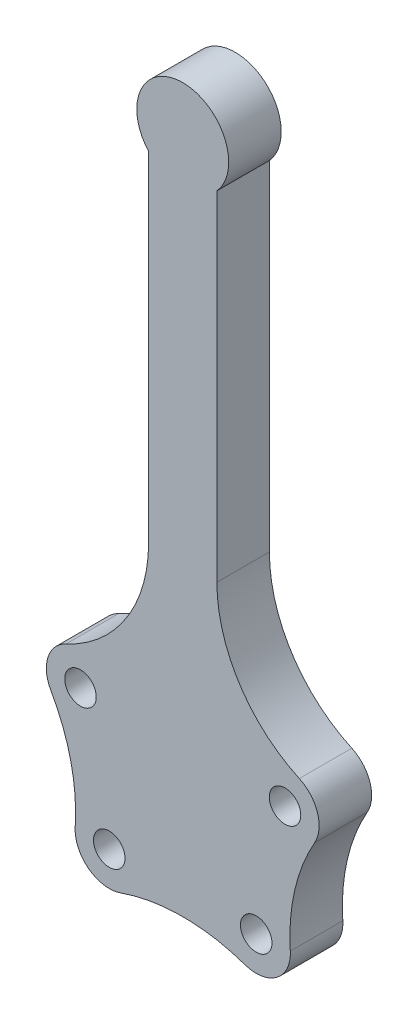
ISO-10303-21;
HEADER;
FILE_DESCRIPTION(('STEP AP214'),'2;1');
FILE_NAME('part.step','',(''),(''),'','','');
FILE_SCHEMA(('AUTOMOTIVE_DESIGN { 1 0 10303 214 1 1 1 1 }'));
ENDSEC;
DATA;
#1=APPLICATION_CONTEXT('core data for automotive mechanical design processes');
#2=APPLICATION_PROTOCOL_DEFINITION('international standard','automotive_design',2000,#1);
#3=PRODUCT_CONTEXT('',#1,'mechanical');
#4=PRODUCT('Part','Part','',(#3));
#5=PRODUCT_RELATED_PRODUCT_CATEGORY('part','',(#4));
#6=PRODUCT_DEFINITION_FORMATION('','',#4);
#7=PRODUCT_DEFINITION_CONTEXT('part definition',#1,'design');
#8=PRODUCT_DEFINITION('design','',#6,#7);
#9=PRODUCT_DEFINITION_SHAPE('','',#8);
#10=(LENGTH_UNIT() NAMED_UNIT(*) SI_UNIT(.MILLI.,.METRE.));
#11=(NAMED_UNIT(*) PLANE_ANGLE_UNIT() SI_UNIT($,.RADIAN.));
#12=(NAMED_UNIT(*) SI_UNIT($,.STERADIAN.) SOLID_ANGLE_UNIT());
#13=UNCERTAINTY_MEASURE_WITH_UNIT(LENGTH_MEASURE(1.E-05),#10,'distance_accuracy_value','');
#14=(GEOMETRIC_REPRESENTATION_CONTEXT(3) GLOBAL_UNCERTAINTY_ASSIGNED_CONTEXT((#13)) GLOBAL_UNIT_ASSIGNED_CONTEXT((#10,
#11,#12)) REPRESENTATION_CONTEXT('',''));
#15=CARTESIAN_POINT('',(0.,0.,0.));
#16=DIRECTION('',(0.,0.,1.));
#17=DIRECTION('',(1.,0.,0.));
#18=AXIS2_PLACEMENT_3D('',#15,#16,#17);
#19=CARTESIAN_POINT('',(38948.1934291581,20327.8011800405,20000.));
#20=DIRECTION('',(0.,0.,-1.));
#21=DIRECTION('',(-1.,0.,0.));
#22=AXIS2_PLACEMENT_3D('',#19,#20,#21);
#23=CYLINDRICAL_SURFACE('',#22,6000.);
#24=CARTESIAN_POINT('',(38948.1934291581,20327.8011800405,20000.));
#25=DIRECTION('',(0.,0.,1.));
#26=DIRECTION('',(1.,0.,0.));
#27=AXIS2_PLACEMENT_3D('',#24,#25,#26);
#28=CIRCLE('',#27,6000.);
#29=CARTESIAN_POINT('',(44948.1934291581,20327.8011800405,20000.));
#30=VERTEX_POINT('',#29);
#31=EDGE_CURVE('E256',#30,#30,#28,.F.);
#32=ORIENTED_EDGE('',*,*,#31,.F.);
#33=EDGE_LOOP('',(#32));
#34=FACE_BOUND('',#33,.T.);
#35=CARTESIAN_POINT('',(38948.1934291581,20327.8011800405,0.));
#36=DIRECTION('',(0.,0.,1.));
#37=DIRECTION('',(1.,0.,0.));
#38=AXIS2_PLACEMENT_3D('',#35,#36,#37);
#39=CIRCLE('',#38,6000.);
#40=CARTESIAN_POINT('',(44948.1934291581,20327.8011800405,0.));
#41=VERTEX_POINT('',#40);
#42=EDGE_CURVE('E312',#41,#41,#39,.F.);
#43=ORIENTED_EDGE('',*,*,#42,.T.);
#44=EDGE_LOOP('',(#43));
#45=FACE_BOUND('',#44,.T.);
#46=ADVANCED_FACE('F117',(#34,#45),#23,.F.);
#47=CARTESIAN_POINT('',(-38950.4949683036,20327.8011800405,20000.));
#48=DIRECTION('',(0.,0.,-1.));
#49=DIRECTION('',(-1.,0.,0.));
#50=AXIS2_PLACEMENT_3D('',#47,#48,#49);
#51=CYLINDRICAL_SURFACE('',#50,6000.);
#52=CARTESIAN_POINT('',(-38950.4949683036,20327.8011800405,20000.));
#53=DIRECTION('',(0.,0.,1.));
#54=DIRECTION('',(1.,0.,0.));
#55=AXIS2_PLACEMENT_3D('',#52,#53,#54);
#56=CIRCLE('',#55,6000.);
#57=CARTESIAN_POINT('',(-32950.4949683036,20327.8011800405,20000.));
#58=VERTEX_POINT('',#57);
#59=EDGE_CURVE('E252',#58,#58,#56,.T.);
#60=ORIENTED_EDGE('',*,*,#59,.T.);
#61=EDGE_LOOP('',(#60));
#62=FACE_BOUND('',#61,.T.);
#63=CARTESIAN_POINT('',(-38950.4949683036,20327.8011800405,0.));
#64=DIRECTION('',(0.,0.,1.));
#65=DIRECTION('',(1.,0.,0.));
#66=AXIS2_PLACEMENT_3D('',#63,#64,#65);
#67=CIRCLE('',#66,6000.);
#68=CARTESIAN_POINT('',(-32950.4949683036,20327.8011800405,0.));
#69=VERTEX_POINT('',#68);
#70=EDGE_CURVE('E308',#69,#69,#67,.T.);
#71=ORIENTED_EDGE('',*,*,#70,.F.);
#72=EDGE_LOOP('',(#71));
#73=FACE_BOUND('',#72,.T.);
#74=ADVANCED_FACE('F402',(#62,#73),#51,.F.);
#75=CARTESIAN_POINT('',(27985.1400829734,-27359.9179610255,20000.));
#76=DIRECTION('',(0.,0.,-1.));
#77=DIRECTION('',(-1.,0.,0.));
#78=AXIS2_PLACEMENT_3D('',#75,#76,#77);
#79=CYLINDRICAL_SURFACE('',#78,6000.);
#80=CARTESIAN_POINT('',(27985.1400829734,-27359.9179610255,20000.));
#81=DIRECTION('',(0.,0.,1.));
#82=DIRECTION('',(1.,0.,0.));
#83=AXIS2_PLACEMENT_3D('',#80,#81,#82);
#84=CIRCLE('',#83,6000.);
#85=CARTESIAN_POINT('',(33985.1400829734,-27359.9179610255,20000.));
#86=VERTEX_POINT('',#85);
#87=EDGE_CURVE('E248',#86,#86,#84,.T.);
#88=ORIENTED_EDGE('',*,*,#87,.T.);
#89=EDGE_LOOP('',(#88));
#90=FACE_BOUND('',#89,.T.);
#91=CARTESIAN_POINT('',(27985.1400829734,-27359.9179610255,0.));
#92=DIRECTION('',(0.,0.,1.));
#93=DIRECTION('',(1.,0.,0.));
#94=AXIS2_PLACEMENT_3D('',#91,#92,#93);
#95=CIRCLE('',#94,6000.);
#96=CARTESIAN_POINT('',(33985.1400829734,-27359.9179610255,0.));
#97=VERTEX_POINT('',#96);
#98=EDGE_CURVE('E304',#97,#97,#95,.T.);
#99=ORIENTED_EDGE('',*,*,#98,.F.);
#100=EDGE_LOOP('',(#99));
#101=FACE_BOUND('',#100,.T.);
#102=ADVANCED_FACE('F408',(#90,#101),#79,.F.);
#103=CARTESIAN_POINT('',(-27987.4416221189,-27359.9179610255,20000.));
#104=DIRECTION('',(0.,0.,-1.));
#105=DIRECTION('',(-1.,0.,0.));
#106=AXIS2_PLACEMENT_3D('',#103,#104,#105);
#107=CYLINDRICAL_SURFACE('',#106,6000.);
#108=CARTESIAN_POINT('',(-27987.4416221189,-27359.9179610255,20000.));
#109=DIRECTION('',(0.,0.,1.));
#110=DIRECTION('',(1.,0.,0.));
#111=AXIS2_PLACEMENT_3D('',#108,#109,#110);
#112=CIRCLE('',#111,6000.);
#113=CARTESIAN_POINT('',(-21987.4416221189,-27359.9179610255,20000.));
#114=VERTEX_POINT('',#113);
#115=EDGE_CURVE('E241',#114,#114,#112,.T.);
#116=ORIENTED_EDGE('',*,*,#115,.T.);
#117=EDGE_LOOP('',(#116));
#118=FACE_BOUND('',#117,.T.);
#119=CARTESIAN_POINT('',(-27987.4416221189,-27359.9179610255,0.));
#120=DIRECTION('',(0.,0.,1.));
#121=DIRECTION('',(1.,0.,0.));
#122=AXIS2_PLACEMENT_3D('',#119,#120,#121);
#123=CIRCLE('',#122,6000.);
#124=CARTESIAN_POINT('',(-21987.4416221189,-27359.9179610255,0.));
#125=VERTEX_POINT('',#124);
#126=EDGE_CURVE('E300',#125,#125,#123,.T.);
#127=ORIENTED_EDGE('',*,*,#126,.F.);
#128=EDGE_LOOP('',(#127));
#129=FACE_BOUND('',#128,.T.);
#130=ADVANCED_FACE('F418',(#118,#129),#107,.F.);
#131=CARTESIAN_POINT('',(66998.8492304273,81173.1848103433,20000.));
#132=DIRECTION('',(0.,0.,-1.));
#133=DIRECTION('',(-1.,0.,0.));
#134=AXIS2_PLACEMENT_3D('',#131,#132,#133);
#135=CYLINDRICAL_SURFACE('',#134,54000.);
#136=CARTESIAN_POINT('',(66998.8492304273,81173.1848103433,0.));
#137=DIRECTION('',(0.,0.,1.));
#138=DIRECTION('',(1.,0.,0.));
#139=AXIS2_PLACEMENT_3D('',#136,#137,#138);
#140=CIRCLE('',#139,54000.);
#141=CARTESIAN_POINT('',(44390.8579876134,32133.6218844276,0.));
#142=VERTEX_POINT('',#141);
#143=CARTESIAN_POINT('',(12998.8492304273,81173.1848103433,0.));
#144=VERTEX_POINT('',#143);
#145=EDGE_CURVE('E264',#142,#144,#140,.F.);
#146=ORIENTED_EDGE('',*,*,#145,.T.);
#147=DIRECTION('',(0.,0.,-1.));
#148=VECTOR('',#147,1.);
#149=CARTESIAN_POINT('',(12998.8492304273,81173.1848103433,20000.));
#150=LINE('',#149,#148);
#151=CARTESIAN_POINT('',(12998.8492304273,81173.1848103433,20000.));
#152=VERTEX_POINT('',#151);
#153=EDGE_CURVE('E128',#152,#144,#150,.T.);
#154=ORIENTED_EDGE('',*,*,#153,.F.);
#155=CARTESIAN_POINT('',(66998.8492304273,81173.1848103433,20000.));
#156=DIRECTION('',(0.,0.,1.));
#157=DIRECTION('',(1.,0.,0.));
#158=AXIS2_PLACEMENT_3D('',#155,#156,#157);
#159=CIRCLE('',#158,54000.);
#160=CARTESIAN_POINT('',(44390.8579876134,32133.6218844276,20000.));
#161=VERTEX_POINT('',#160);
#162=EDGE_CURVE('E373',#161,#152,#159,.F.);
#163=ORIENTED_EDGE('',*,*,#162,.F.);
#164=DIRECTION('',(0.,0.,-1.));
#165=VECTOR('',#164,1.);
#166=CARTESIAN_POINT('',(44390.8579876134,32133.6218844276,20000.));
#167=LINE('',#166,#165);
#168=EDGE_CURVE('E12',#161,#142,#167,.T.);
#169=ORIENTED_EDGE('',*,*,#168,.T.);
#170=EDGE_LOOP('',(#146,#154,#163,#169));
#171=FACE_BOUND('',#170,.T.);
#172=ADVANCED_FACE('F422',(#171),#135,.F.);
#173=CARTESIAN_POINT('',(12998.8492304273,1.78842359855495E-13,20000.));
#174=DIRECTION('',(-1.,0.,0.));
#175=DIRECTION('',(0.,-1.,0.));
#176=AXIS2_PLACEMENT_3D('',#173,#174,#175);
#177=PLANE('',#176);
#178=DIRECTION('',(0.,1.,0.));
#179=VECTOR('',#178,1.);
#180=CARTESIAN_POINT('',(12998.8492304273,1.78842359855495E-13,0.));
#181=LINE('',#180,#179);
#182=CARTESIAN_POINT('',(12998.8492304273,210284.62548614,0.));
#183=VERTEX_POINT('',#182);
#184=EDGE_CURVE('E268',#144,#183,#181,.T.);
#185=ORIENTED_EDGE('',*,*,#184,.T.);
#186=DIRECTION('',(0.,0.,-1.));
#187=VECTOR('',#186,1.);
#188=CARTESIAN_POINT('',(12998.8492304273,210284.62548614,20000.));
#189=LINE('',#188,#187);
#190=CARTESIAN_POINT('',(12998.8492304273,210284.62548614,20000.));
#191=VERTEX_POINT('',#190);
#192=EDGE_CURVE('E338',#191,#183,#189,.T.);
#193=ORIENTED_EDGE('',*,*,#192,.F.);
#194=DIRECTION('',(0.,1.,0.));
#195=VECTOR('',#194,1.);
#196=CARTESIAN_POINT('',(12998.8492304273,1.78842359855495E-13,20000.));
#197=LINE('',#196,#195);
#198=EDGE_CURVE('E367',#152,#191,#197,.T.);
#199=ORIENTED_EDGE('',*,*,#198,.F.);
#200=ORIENTED_EDGE('',*,*,#153,.T.);
#201=EDGE_LOOP('',(#185,#193,#199,#200));
#202=FACE_BOUND('',#201,.T.);
#203=ADVANCED_FACE('F506',(#202),#177,.F.);
#204=CARTESIAN_POINT('',(-13001.1507695727,8.94370125866532E-13,20000.));
#205=DIRECTION('',(-1.,0.,0.));
#206=DIRECTION('',(0.,-1.,0.));
#207=AXIS2_PLACEMENT_3D('',#204,#205,#206);
#208=PLANE('',#207);
#209=DIRECTION('',(0.,1.,0.));
#210=VECTOR('',#209,1.);
#211=CARTESIAN_POINT('',(-13001.1507695727,8.94370125866532E-13,0.));
#212=LINE('',#211,#210);
#213=CARTESIAN_POINT('',(-13001.1507695727,81173.1848103433,0.));
#214=VERTEX_POINT('',#213);
#215=CARTESIAN_POINT('',(-13001.1507695727,210284.62548614,0.));
#216=VERTEX_POINT('',#215);
#217=EDGE_CURVE('E272',#214,#216,#212,.T.);
#218=ORIENTED_EDGE('',*,*,#217,.F.);
#219=DIRECTION('',(0.,0.,-1.));
#220=VECTOR('',#219,1.);
#221=CARTESIAN_POINT('',(-13001.1507695727,81173.1848103433,20000.));
#222=LINE('',#221,#220);
#223=CARTESIAN_POINT('',(-13001.1507695727,81173.1848103433,20000.));
#224=VERTEX_POINT('',#223);
#225=EDGE_CURVE('E332',#224,#214,#222,.T.);
#226=ORIENTED_EDGE('',*,*,#225,.F.);
#227=DIRECTION('',(0.,1.,0.));
#228=VECTOR('',#227,1.);
#229=CARTESIAN_POINT('',(-13001.1507695727,8.94370125866532E-13,20000.));
#230=LINE('',#229,#228);
#231=CARTESIAN_POINT('',(-13001.1507695727,210284.62548614,20000.));
#232=VERTEX_POINT('',#231);
#233=EDGE_CURVE('E362',#224,#232,#230,.T.);
#234=ORIENTED_EDGE('',*,*,#233,.T.);
#235=DIRECTION('',(0.,0.,-1.));
#236=VECTOR('',#235,1.);
#237=CARTESIAN_POINT('',(-13001.1507695727,210284.62548614,20000.));
#238=LINE('',#237,#236);
#239=EDGE_CURVE('E335',#232,#216,#238,.T.);
#240=ORIENTED_EDGE('',*,*,#239,.T.);
#241=EDGE_LOOP('',(#218,#226,#234,#240));
#242=FACE_BOUND('',#241,.T.);
#243=ADVANCED_FACE('F361',(#242),#208,.T.);
#244=CARTESIAN_POINT('',(-67001.1507695727,81173.1848103433,20000.));
#245=DIRECTION('',(0.,0.,-1.));
#246=DIRECTION('',(-1.,0.,0.));
#247=AXIS2_PLACEMENT_3D('',#244,#245,#246);
#248=CYLINDRICAL_SURFACE('',#247,54000.);
#249=CARTESIAN_POINT('',(-67001.1507695727,81173.1848103433,0.));
#250=DIRECTION('',(0.,0.,1.));
#251=DIRECTION('',(1.,0.,0.));
#252=AXIS2_PLACEMENT_3D('',#249,#250,#251);
#253=CIRCLE('',#252,54000.);
#254=CARTESIAN_POINT('',(-44393.1595267588,32133.6218844276,0.));
#255=VERTEX_POINT('',#254);
#256=EDGE_CURVE('E276',#255,#214,#253,.T.);
#257=ORIENTED_EDGE('',*,*,#256,.F.);
#258=DIRECTION('',(0.,0.,-1.));
#259=VECTOR('',#258,1.);
#260=CARTESIAN_POINT('',(-44393.1595267588,32133.6218844276,20000.));
#261=LINE('',#260,#259);
#262=CARTESIAN_POINT('',(-44393.1595267588,32133.6218844276,20000.));
#263=VERTEX_POINT('',#262);
#264=EDGE_CURVE('E329',#263,#255,#261,.T.);
#265=ORIENTED_EDGE('',*,*,#264,.F.);
#266=CARTESIAN_POINT('',(-67001.1507695727,81173.1848103433,20000.));
#267=DIRECTION('',(0.,0.,1.));
#268=DIRECTION('',(1.,0.,0.));
#269=AXIS2_PLACEMENT_3D('',#266,#267,#268);
#270=CIRCLE('',#269,54000.);
#271=EDGE_CURVE('E366',#263,#224,#270,.T.);
#272=ORIENTED_EDGE('',*,*,#271,.T.);
#273=ORIENTED_EDGE('',*,*,#225,.T.);
#274=EDGE_LOOP('',(#257,#265,#272,#273));
#275=FACE_BOUND('',#274,.T.);
#276=ADVANCED_FACE('F490',(#275),#248,.F.);
#277=CARTESIAN_POINT('',(-38950.4949683036,20327.8011800405,20000.));
#278=DIRECTION('',(0.,0.,-1.));
#279=DIRECTION('',(-1.,0.,0.));
#280=AXIS2_PLACEMENT_3D('',#277,#278,#279);
#281=CYLINDRICAL_SURFACE('',#280,13000.);
#282=CARTESIAN_POINT('',(-38950.4949683036,20327.8011800405,0.));
#283=DIRECTION('',(0.,0.,1.));
#284=DIRECTION('',(1.,0.,0.));
#285=AXIS2_PLACEMENT_3D('',#282,#283,#284);
#286=CIRCLE('',#285,13000.);
#287=CARTESIAN_POINT('',(-50245.4913477451,13891.7265387392,0.));
#288=VERTEX_POINT('',#287);
#289=EDGE_CURVE('E280',#255,#288,#286,.T.);
#290=ORIENTED_EDGE('',*,*,#289,.T.);
#291=DIRECTION('',(0.,0.,-1.));
#292=VECTOR('',#291,1.);
#293=CARTESIAN_POINT('',(-50245.4913477451,13891.7265387392,20000.));
#294=LINE('',#293,#292);
#295=CARTESIAN_POINT('',(-50245.4913477451,13891.7265387392,20000.));
#296=VERTEX_POINT('',#295);
#297=EDGE_CURVE('E326',#296,#288,#294,.T.);
#298=ORIENTED_EDGE('',*,*,#297,.F.);
#299=CARTESIAN_POINT('',(-38950.4949683036,20327.8011800405,20000.));
#300=DIRECTION('',(0.,0.,1.));
#301=DIRECTION('',(1.,0.,0.));
#302=AXIS2_PLACEMENT_3D('',#299,#300,#301);
#303=CIRCLE('',#302,13000.);
#304=EDGE_CURVE('E371',#263,#296,#303,.T.);
#305=ORIENTED_EDGE('',*,*,#304,.F.);
#306=ORIENTED_EDGE('',*,*,#264,.T.);
#307=EDGE_LOOP('',(#290,#298,#305,#306));
#308=FACE_BOUND('',#307,.T.);
#309=ADVANCED_FACE('F389',(#308),#281,.T.);
#310=CARTESIAN_POINT('',(-112802.394372345,-21754.2253207756,20000.));
#311=DIRECTION('',(0.,0.,-1.));
#312=DIRECTION('',(-1.,0.,0.));
#313=AXIS2_PLACEMENT_3D('',#310,#311,#312);
#314=CYLINDRICAL_SURFACE('',#313,72000.);
#315=CARTESIAN_POINT('',(-112802.394372345,-21754.2253207756,0.));
#316=DIRECTION('',(0.,0.,1.));
#317=DIRECTION('',(1.,0.,0.));
#318=AXIS2_PLACEMENT_3D('',#315,#316,#317);
#319=CIRCLE('',#318,72000.);
#320=CARTESIAN_POINT('',(-40959.1402780358,-26502.5767336931,0.));
#321=VERTEX_POINT('',#320);
#322=EDGE_CURVE('E284',#321,#288,#319,.T.);
#323=ORIENTED_EDGE('',*,*,#322,.F.);
#324=DIRECTION('',(0.,0.,-1.));
#325=VECTOR('',#324,1.);
#326=CARTESIAN_POINT('',(-40959.1402780358,-26502.5767336931,20000.));
#327=LINE('',#326,#325);
#328=CARTESIAN_POINT('',(-40959.1402780358,-26502.5767336931,20000.));
#329=VERTEX_POINT('',#328);
#330=EDGE_CURVE('E323',#329,#321,#327,.T.);
#331=ORIENTED_EDGE('',*,*,#330,.F.);
#332=CARTESIAN_POINT('',(-112802.394372345,-21754.2253207756,20000.));
#333=DIRECTION('',(0.,0.,1.));
#334=DIRECTION('',(1.,0.,0.));
#335=AXIS2_PLACEMENT_3D('',#332,#333,#334);
#336=CIRCLE('',#335,72000.);
#337=EDGE_CURVE('E379',#329,#296,#336,.T.);
#338=ORIENTED_EDGE('',*,*,#337,.T.);
#339=ORIENTED_EDGE('',*,*,#297,.T.);
#340=EDGE_LOOP('',(#323,#331,#338,#339));
#341=FACE_BOUND('',#340,.T.);
#342=ADVANCED_FACE('F385',(#341),#314,.F.);
#343=CARTESIAN_POINT('',(-27987.4416221189,-27359.9179610255,20000.));
#344=DIRECTION('',(0.,0.,-1.));
#345=DIRECTION('',(-1.,0.,0.));
#346=AXIS2_PLACEMENT_3D('',#343,#344,#345);
#347=CYLINDRICAL_SURFACE('',#346,13000.);
#348=CARTESIAN_POINT('',(-27987.4416221189,-27359.9179610255,0.));
#349=DIRECTION('',(0.,0.,1.));
#350=DIRECTION('',(1.,0.,0.));
#351=AXIS2_PLACEMENT_3D('',#348,#349,#350);
#352=CIRCLE('',#351,13000.);
#353=CARTESIAN_POINT('',(-23707.1853740824,-39635.0719906556,0.));
#354=VERTEX_POINT('',#353);
#355=EDGE_CURVE('E288',#321,#354,#352,.T.);
#356=ORIENTED_EDGE('',*,*,#355,.T.);
#357=DIRECTION('',(0.,0.,-1.));
#358=VECTOR('',#357,1.);
#359=CARTESIAN_POINT('',(-23707.1853740824,-39635.0719906556,20000.));
#360=LINE('',#359,#358);
#361=CARTESIAN_POINT('',(-23707.1853740824,-39635.0719906556,20000.));
#362=VERTEX_POINT('',#361);
#363=EDGE_CURVE('E226',#362,#354,#360,.T.);
#364=ORIENTED_EDGE('',*,*,#363,.F.);
#365=CARTESIAN_POINT('',(-27987.4416221189,-27359.9179610255,20000.));
#366=DIRECTION('',(0.,0.,1.));
#367=DIRECTION('',(1.,0.,0.));
#368=AXIS2_PLACEMENT_3D('',#365,#366,#367);
#369=CIRCLE('',#368,13000.);
#370=EDGE_CURVE('E233',#329,#362,#369,.T.);
#371=ORIENTED_EDGE('',*,*,#370,.F.);
#372=ORIENTED_EDGE('',*,*,#330,.T.);
#373=EDGE_LOOP('',(#356,#364,#371,#372));
#374=FACE_BOUND('',#373,.T.);
#375=ADVANCED_FACE('F392',(#374),#347,.T.);
#376=CARTESIAN_POINT('',(-1.15076957266471,-107620.540462453,20000.));
#377=DIRECTION('',(0.,0.,-1.));
#378=DIRECTION('',(-1.,0.,0.));
#379=AXIS2_PLACEMENT_3D('',#376,#377,#378);
#380=CYLINDRICAL_SURFACE('',#379,72000.);
#381=CARTESIAN_POINT('',(-1.15076957266471,-107620.540462453,0.));
#382=DIRECTION('',(0.,0.,1.));
#383=DIRECTION('',(1.,0.,0.));
#384=AXIS2_PLACEMENT_3D('',#381,#382,#383);
#385=CIRCLE('',#384,72000.);
#386=CARTESIAN_POINT('',(23704.883834937,-39635.0719906556,0.));
#387=VERTEX_POINT('',#386);
#388=EDGE_CURVE('E220',#387,#354,#385,.T.);
#389=ORIENTED_EDGE('',*,*,#388,.F.);
#390=DIRECTION('',(0.,0.,-1.));
#391=VECTOR('',#390,1.);
#392=CARTESIAN_POINT('',(23704.883834937,-39635.0719906556,20000.));
#393=LINE('',#392,#391);
#394=CARTESIAN_POINT('',(23704.883834937,-39635.0719906556,20000.));
#395=VERTEX_POINT('',#394);
#396=EDGE_CURVE('E215',#395,#387,#393,.T.);
#397=ORIENTED_EDGE('',*,*,#396,.F.);
#398=CARTESIAN_POINT('',(-1.15076957266471,-107620.540462453,20000.));
#399=DIRECTION('',(0.,0.,1.));
#400=DIRECTION('',(1.,0.,0.));
#401=AXIS2_PLACEMENT_3D('',#398,#399,#400);
#402=CIRCLE('',#401,72000.);
#403=EDGE_CURVE('E218',#395,#362,#402,.T.);
#404=ORIENTED_EDGE('',*,*,#403,.T.);
#405=ORIENTED_EDGE('',*,*,#363,.T.);
#406=EDGE_LOOP('',(#389,#397,#404,#405));
#407=FACE_BOUND('',#406,.T.);
#408=ADVANCED_FACE('F217',(#407),#380,.F.);
#409=CARTESIAN_POINT('',(27985.1400829734,-27359.9179610255,20000.));
#410=DIRECTION('',(0.,0.,-1.));
#411=DIRECTION('',(-1.,0.,0.));
#412=AXIS2_PLACEMENT_3D('',#409,#410,#411);
#413=CYLINDRICAL_SURFACE('',#412,13000.);
#414=CARTESIAN_POINT('',(27985.1400829734,-27359.9179610255,0.));
#415=DIRECTION('',(0.,0.,1.));
#416=DIRECTION('',(1.,0.,0.));
#417=AXIS2_PLACEMENT_3D('',#414,#415,#416);
#418=CIRCLE('',#417,13000.);
#419=CARTESIAN_POINT('',(40956.8387388903,-26502.5767336931,0.));
#420=VERTEX_POINT('',#419);
#421=EDGE_CURVE('E294',#420,#387,#418,.F.);
#422=ORIENTED_EDGE('',*,*,#421,.F.);
#423=DIRECTION('',(0.,0.,-1.));
#424=VECTOR('',#423,1.);
#425=CARTESIAN_POINT('',(40956.8387388903,-26502.5767336931,20000.));
#426=LINE('',#425,#424);
#427=CARTESIAN_POINT('',(40956.8387388903,-26502.5767336931,20000.));
#428=VERTEX_POINT('',#427);
#429=EDGE_CURVE('E176',#428,#420,#426,.T.);
#430=ORIENTED_EDGE('',*,*,#429,.F.);
#431=CARTESIAN_POINT('',(27985.1400829734,-27359.9179610255,20000.));
#432=DIRECTION('',(0.,0.,1.));
#433=DIRECTION('',(1.,0.,0.));
#434=AXIS2_PLACEMENT_3D('',#431,#432,#433);
#435=CIRCLE('',#434,13000.);
#436=EDGE_CURVE('E230',#428,#395,#435,.F.);
#437=ORIENTED_EDGE('',*,*,#436,.T.);
#438=ORIENTED_EDGE('',*,*,#396,.T.);
#439=EDGE_LOOP('',(#422,#430,#437,#438));
#440=FACE_BOUND('',#439,.T.);
#441=ADVANCED_FACE('F237',(#440),#413,.T.);
#442=CARTESIAN_POINT('',(112800.092833199,-21754.2253207756,20000.));
#443=DIRECTION('',(0.,0.,-1.));
#444=DIRECTION('',(-1.,0.,0.));
#445=AXIS2_PLACEMENT_3D('',#442,#443,#444);
#446=CYLINDRICAL_SURFACE('',#445,72000.);
#447=CARTESIAN_POINT('',(112800.092833199,-21754.2253207756,0.));
#448=DIRECTION('',(0.,0.,1.));
#449=DIRECTION('',(1.,0.,0.));
#450=AXIS2_PLACEMENT_3D('',#447,#448,#449);
#451=CIRCLE('',#450,72000.);
#452=CARTESIAN_POINT('',(50243.1898085997,13891.7265387392,0.));
#453=VERTEX_POINT('',#452);
#454=EDGE_CURVE('E297',#420,#453,#451,.F.);
#455=ORIENTED_EDGE('',*,*,#454,.T.);
#456=DIRECTION('',(0.,0.,-1.));
#457=VECTOR('',#456,1.);
#458=CARTESIAN_POINT('',(50243.1898085997,13891.7265387392,20000.));
#459=LINE('',#458,#457);
#460=CARTESIAN_POINT('',(50243.1898085997,13891.7265387392,20000.));
#461=VERTEX_POINT('',#460);
#462=EDGE_CURVE('E183',#461,#453,#459,.T.);
#463=ORIENTED_EDGE('',*,*,#462,.F.);
#464=CARTESIAN_POINT('',(112800.092833199,-21754.2253207756,20000.));
#465=DIRECTION('',(0.,0.,1.));
#466=DIRECTION('',(1.,0.,0.));
#467=AXIS2_PLACEMENT_3D('',#464,#465,#466);
#468=CIRCLE('',#467,72000.);
#469=EDGE_CURVE('E137',#428,#461,#468,.F.);
#470=ORIENTED_EDGE('',*,*,#469,.F.);
#471=ORIENTED_EDGE('',*,*,#429,.T.);
#472=EDGE_LOOP('',(#455,#463,#470,#471));
#473=FACE_BOUND('',#472,.T.);
#474=ADVANCED_FACE('F424',(#473),#446,.F.);
#475=CARTESIAN_POINT('',(38948.1934291581,20327.8011800405,20000.));
#476=DIRECTION('',(0.,0.,-1.));
#477=DIRECTION('',(-1.,0.,0.));
#478=AXIS2_PLACEMENT_3D('',#475,#476,#477);
#479=CYLINDRICAL_SURFACE('',#478,13000.);
#480=CARTESIAN_POINT('',(38948.1934291581,20327.8011800405,0.));
#481=DIRECTION('',(0.,0.,1.));
#482=DIRECTION('',(1.,0.,0.));
#483=AXIS2_PLACEMENT_3D('',#480,#481,#482);
#484=CIRCLE('',#483,13000.);
#485=EDGE_CURVE('E260',#142,#453,#484,.F.);
#486=ORIENTED_EDGE('',*,*,#485,.F.);
#487=ORIENTED_EDGE('',*,*,#168,.F.);
#488=CARTESIAN_POINT('',(38948.1934291581,20327.8011800405,20000.));
#489=DIRECTION('',(0.,0.,1.));
#490=DIRECTION('',(1.,0.,0.));
#491=AXIS2_PLACEMENT_3D('',#488,#489,#490);
#492=CIRCLE('',#491,13000.);
#493=EDGE_CURVE('E316',#161,#461,#492,.F.);
#494=ORIENTED_EDGE('',*,*,#493,.T.);
#495=ORIENTED_EDGE('',*,*,#462,.T.);
#496=EDGE_LOOP('',(#486,#487,#494,#495));
#497=FACE_BOUND('',#496,.T.);
#498=ADVANCED_FACE('F427',(#497),#479,.T.);
#499=CARTESIAN_POINT('',(0.,0.,0.));
#500=DIRECTION('',(0.,0.,1.));
#501=DIRECTION('',(1.,0.,0.));
#502=AXIS2_PLACEMENT_3D('',#499,#500,#501);
#503=PLANE('',#502);
#504=ORIENTED_EDGE('',*,*,#485,.T.);
#505=ORIENTED_EDGE('',*,*,#454,.F.);
#506=ORIENTED_EDGE('',*,*,#421,.T.);
#507=ORIENTED_EDGE('',*,*,#388,.T.);
#508=ORIENTED_EDGE('',*,*,#355,.F.);
#509=ORIENTED_EDGE('',*,*,#322,.T.);
#510=ORIENTED_EDGE('',*,*,#289,.F.);
#511=ORIENTED_EDGE('',*,*,#256,.T.);
#512=ORIENTED_EDGE('',*,*,#217,.T.);
#513=CARTESIAN_POINT('',(-1.15076957270657,222000.,0.));
#514=DIRECTION('',(0.,0.,1.));
#515=DIRECTION('',(1.,0.,0.));
#516=AXIS2_PLACEMENT_3D('',#513,#514,#515);
#517=CIRCLE('',#516,17500.);
#518=EDGE_CURVE('E121',#183,#216,#517,.T.);
#519=ORIENTED_EDGE('',*,*,#518,.F.);
#520=ORIENTED_EDGE('',*,*,#184,.F.);
#521=ORIENTED_EDGE('',*,*,#145,.F.);
#522=EDGE_LOOP('',(#504,#505,#506,#507,#508,#509,#510,#511,#512,#519,#520,#521));
#523=FACE_BOUND('',#522,.T.);
#524=ORIENTED_EDGE('',*,*,#126,.T.);
#525=EDGE_LOOP('',(#524));
#526=FACE_BOUND('',#525,.T.);
#527=ORIENTED_EDGE('',*,*,#98,.T.);
#528=EDGE_LOOP('',(#527));
#529=FACE_BOUND('',#528,.T.);
#530=ORIENTED_EDGE('',*,*,#70,.T.);
#531=EDGE_LOOP('',(#530));
#532=FACE_BOUND('',#531,.T.);
#533=ORIENTED_EDGE('',*,*,#42,.F.);
#534=EDGE_LOOP('',(#533));
#535=FACE_BOUND('',#534,.T.);
#536=ADVANCED_FACE('F356',(#523,#526,#529,#532,#535),#503,.F.);
#537=CARTESIAN_POINT('',(0.,0.,20000.));
#538=DIRECTION('',(0.,0.,1.));
#539=DIRECTION('',(1.,0.,0.));
#540=AXIS2_PLACEMENT_3D('',#537,#538,#539);
#541=PLANE('',#540);
#542=ORIENTED_EDGE('',*,*,#493,.F.);
#543=ORIENTED_EDGE('',*,*,#162,.T.);
#544=ORIENTED_EDGE('',*,*,#198,.T.);
#545=CARTESIAN_POINT('',(-1.15076957270657,222000.,20000.));
#546=DIRECTION('',(0.,0.,1.));
#547=DIRECTION('',(1.,0.,0.));
#548=AXIS2_PLACEMENT_3D('',#545,#546,#547);
#549=CIRCLE('',#548,17500.);
#550=EDGE_CURVE('E265',#191,#232,#549,.T.);
#551=ORIENTED_EDGE('',*,*,#550,.T.);
#552=ORIENTED_EDGE('',*,*,#233,.F.);
#553=ORIENTED_EDGE('',*,*,#271,.F.);
#554=ORIENTED_EDGE('',*,*,#304,.T.);
#555=ORIENTED_EDGE('',*,*,#337,.F.);
#556=ORIENTED_EDGE('',*,*,#370,.T.);
#557=ORIENTED_EDGE('',*,*,#403,.F.);
#558=ORIENTED_EDGE('',*,*,#436,.F.);
#559=ORIENTED_EDGE('',*,*,#469,.T.);
#560=EDGE_LOOP('',(#542,#543,#544,#551,#552,#553,#554,#555,#556,#557,#558,#559));
#561=FACE_BOUND('',#560,.T.);
#562=ORIENTED_EDGE('',*,*,#115,.F.);
#563=EDGE_LOOP('',(#562));
#564=FACE_BOUND('',#563,.T.);
#565=ORIENTED_EDGE('',*,*,#87,.F.);
#566=EDGE_LOOP('',(#565));
#567=FACE_BOUND('',#566,.T.);
#568=ORIENTED_EDGE('',*,*,#59,.F.);
#569=EDGE_LOOP('',(#568));
#570=FACE_BOUND('',#569,.T.);
#571=ORIENTED_EDGE('',*,*,#31,.T.);
#572=EDGE_LOOP('',(#571));
#573=FACE_BOUND('',#572,.T.);
#574=ADVANCED_FACE('F228',(#561,#564,#567,#570,#573),#541,.T.);
#575=CARTESIAN_POINT('',(-1.15076957270657,222000.,20000.));
#576=DIRECTION('',(0.,0.,-1.));
#577=DIRECTION('',(-1.,0.,0.));
#578=AXIS2_PLACEMENT_3D('',#575,#576,#577);
#579=CYLINDRICAL_SURFACE('',#578,17500.);
#580=ORIENTED_EDGE('',*,*,#550,.F.);
#581=ORIENTED_EDGE('',*,*,#192,.T.);
#582=ORIENTED_EDGE('',*,*,#518,.T.);
#583=ORIENTED_EDGE('',*,*,#239,.F.);
#584=EDGE_LOOP('',(#580,#581,#582,#583));
#585=FACE_BOUND('',#584,.T.);
#586=ADVANCED_FACE('F119',(#585),#579,.T.);
#587=CLOSED_SHELL('',(#46,#74,#102,#130,#172,#203,#243,#276,#309,#342,#375,#408,#441,#474,#498,
#536,#574,#586));
#588=MANIFOLD_SOLID_BREP('B2',#587);
#589=ADVANCED_BREP_SHAPE_REPRESENTATION('',(#18,#588),#14);
#590=SHAPE_DEFINITION_REPRESENTATION(#9,#589);
ENDSEC;
END-ISO-10303-21;
